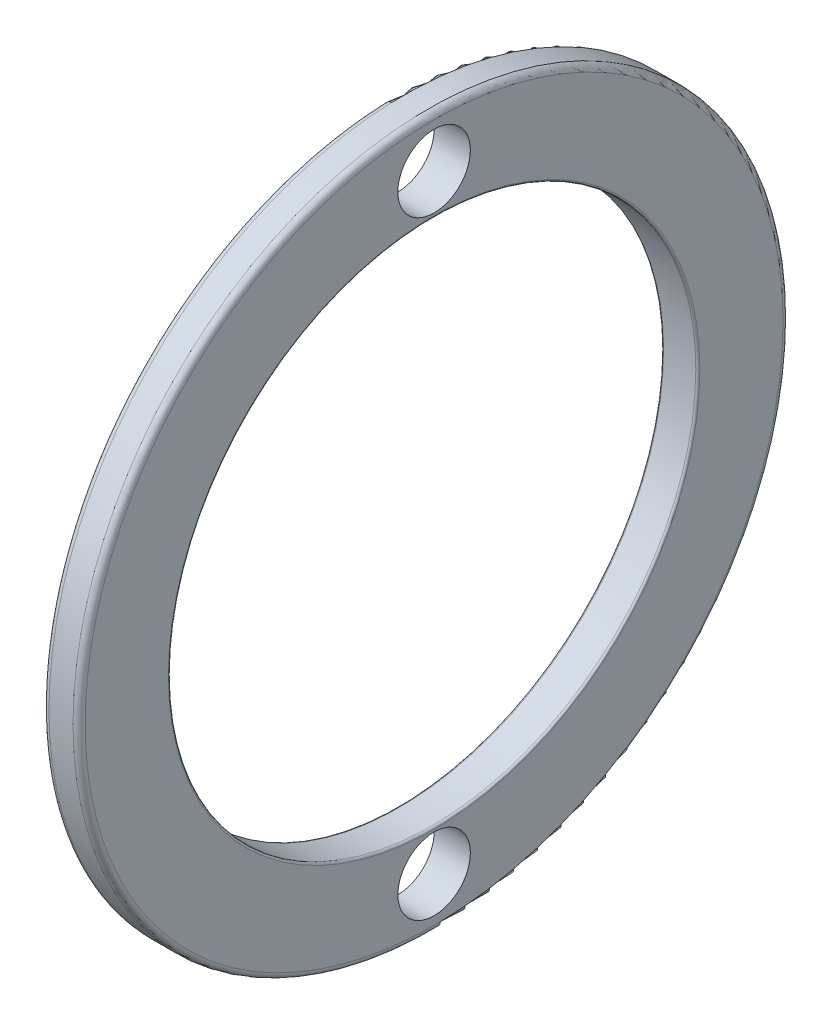
ISO-10303-21;
HEADER;
FILE_DESCRIPTION(('STEP AP214'),'2;1');
FILE_NAME('part.step','',(''),(''),'','','');
FILE_SCHEMA(('AUTOMOTIVE_DESIGN { 1 0 10303 214 1 1 1 1 }'));
ENDSEC;
DATA;
#1=APPLICATION_CONTEXT('core data for automotive mechanical design processes');
#2=APPLICATION_PROTOCOL_DEFINITION('international standard','automotive_design',2000,#1);
#3=PRODUCT_CONTEXT('',#1,'mechanical');
#4=PRODUCT('Part','Part','',(#3));
#5=PRODUCT_RELATED_PRODUCT_CATEGORY('part','',(#4));
#6=PRODUCT_DEFINITION_FORMATION('','',#4);
#7=PRODUCT_DEFINITION_CONTEXT('part definition',#1,'design');
#8=PRODUCT_DEFINITION('design','',#6,#7);
#9=PRODUCT_DEFINITION_SHAPE('','',#8);
#10=(LENGTH_UNIT() NAMED_UNIT(*) SI_UNIT(.MILLI.,.METRE.));
#11=(NAMED_UNIT(*) PLANE_ANGLE_UNIT() SI_UNIT($,.RADIAN.));
#12=(NAMED_UNIT(*) SI_UNIT($,.STERADIAN.) SOLID_ANGLE_UNIT());
#13=UNCERTAINTY_MEASURE_WITH_UNIT(LENGTH_MEASURE(1.E-05),#10,'distance_accuracy_value','');
#14=(GEOMETRIC_REPRESENTATION_CONTEXT(3) GLOBAL_UNCERTAINTY_ASSIGNED_CONTEXT((#13)) GLOBAL_UNIT_ASSIGNED_CONTEXT((#10,
#11,#12)) REPRESENTATION_CONTEXT('',''));
#15=CARTESIAN_POINT('',(0.,0.,0.));
#16=DIRECTION('',(0.,0.,1.));
#17=DIRECTION('',(1.,0.,0.));
#18=AXIS2_PLACEMENT_3D('',#15,#16,#17);
#19=CARTESIAN_POINT('',(5.214,34.4,0.));
#20=DIRECTION('',(-1.,0.,0.));
#21=DIRECTION('',(0.,0.,1.));
#22=AXIS2_PLACEMENT_3D('',#19,#20,#21);
#23=PLANE('',#22);
#24=CARTESIAN_POINT('',(5.214,30.,0.));
#25=DIRECTION('',(-1.,0.,0.));
#26=DIRECTION('',(0.,0.,1.));
#27=AXIS2_PLACEMENT_3D('',#24,#25,#26);
#28=CIRCLE('',#27,3.572);
#29=CARTESIAN_POINT('',(5.214,30.,3.572));
#30=VERTEX_POINT('',#29);
#31=EDGE_CURVE('E47',#30,#30,#28,.F.);
#32=ORIENTED_EDGE('',*,*,#31,.T.);
#33=EDGE_LOOP('',(#32));
#34=FACE_BOUND('',#33,.T.);
#35=CARTESIAN_POINT('',(5.214,0.,0.));
#36=DIRECTION('',(1.,0.,0.));
#37=DIRECTION('',(0.,0.,-1.));
#38=AXIS2_PLACEMENT_3D('',#35,#36,#37);
#39=CIRCLE('',#38,26.2);
#40=CARTESIAN_POINT('',(5.214,0.,-26.2));
#41=VERTEX_POINT('',#40);
#42=EDGE_CURVE('E37',#41,#41,#39,.T.);
#43=ORIENTED_EDGE('',*,*,#42,.T.);
#44=EDGE_LOOP('',(#43));
#45=FACE_BOUND('',#44,.T.);
#46=CARTESIAN_POINT('',(5.214,0.,0.));
#47=DIRECTION('',(1.,0.,0.));
#48=DIRECTION('',(0.,0.,-1.));
#49=AXIS2_PLACEMENT_3D('',#46,#47,#48);
#50=CIRCLE('',#49,34.4);
#51=CARTESIAN_POINT('',(5.214,0.,-34.4));
#52=VERTEX_POINT('',#51);
#53=EDGE_CURVE('E10',#52,#52,#50,.T.);
#54=ORIENTED_EDGE('',*,*,#53,.F.);
#55=EDGE_LOOP('',(#54));
#56=FACE_BOUND('',#55,.T.);
#57=CARTESIAN_POINT('',(5.214,-30.,0.));
#58=DIRECTION('',(-1.,0.,0.));
#59=DIRECTION('',(0.,0.,1.));
#60=AXIS2_PLACEMENT_3D('',#57,#58,#59);
#61=CIRCLE('',#60,3.572);
#62=CARTESIAN_POINT('',(5.214,-30.,3.572));
#63=VERTEX_POINT('',#62);
#64=EDGE_CURVE('E48',#63,#63,#61,.F.);
#65=ORIENTED_EDGE('',*,*,#64,.T.);
#66=EDGE_LOOP('',(#65));
#67=FACE_BOUND('',#66,.T.);
#68=ADVANCED_FACE('F29',(#34,#45,#56,#67),#23,.T.);
#69=CARTESIAN_POINT('',(8.786,26.2,0.));
#70=DIRECTION('',(1.,0.,0.));
#71=DIRECTION('',(0.,0.,-1.));
#72=AXIS2_PLACEMENT_3D('',#69,#70,#71);
#73=PLANE('',#72);
#74=CARTESIAN_POINT('',(8.786,30.,0.));
#75=DIRECTION('',(1.,0.,0.));
#76=DIRECTION('',(0.,0.,-1.));
#77=AXIS2_PLACEMENT_3D('',#74,#75,#76);
#78=CIRCLE('',#77,3.572);
#79=CARTESIAN_POINT('',(8.786,30.,-3.572));
#80=VERTEX_POINT('',#79);
#81=EDGE_CURVE('E45',#80,#80,#78,.F.);
#82=ORIENTED_EDGE('',*,*,#81,.T.);
#83=EDGE_LOOP('',(#82));
#84=FACE_BOUND('',#83,.T.);
#85=CARTESIAN_POINT('',(8.786,0.,0.));
#86=DIRECTION('',(1.,0.,0.));
#87=DIRECTION('',(0.,0.,-1.));
#88=AXIS2_PLACEMENT_3D('',#85,#86,#87);
#89=CIRCLE('',#88,34.4);
#90=CARTESIAN_POINT('',(8.786,0.,-34.4));
#91=VERTEX_POINT('',#90);
#92=EDGE_CURVE('E65',#91,#91,#89,.T.);
#93=ORIENTED_EDGE('',*,*,#92,.T.);
#94=EDGE_LOOP('',(#93));
#95=FACE_BOUND('',#94,.T.);
#96=CARTESIAN_POINT('',(8.786,0.,0.));
#97=DIRECTION('',(1.,0.,0.));
#98=DIRECTION('',(0.,0.,-1.));
#99=AXIS2_PLACEMENT_3D('',#96,#97,#98);
#100=CIRCLE('',#99,26.2);
#101=CARTESIAN_POINT('',(8.786,0.,-26.2));
#102=VERTEX_POINT('',#101);
#103=EDGE_CURVE('E68',#102,#102,#100,.T.);
#104=ORIENTED_EDGE('',*,*,#103,.F.);
#105=EDGE_LOOP('',(#104));
#106=FACE_BOUND('',#105,.T.);
#107=CARTESIAN_POINT('',(8.786,-30.,0.));
#108=DIRECTION('',(1.,0.,0.));
#109=DIRECTION('',(0.,0.,-1.));
#110=AXIS2_PLACEMENT_3D('',#107,#108,#109);
#111=CIRCLE('',#110,3.572);
#112=CARTESIAN_POINT('',(8.786,-30.,-3.572));
#113=VERTEX_POINT('',#112);
#114=EDGE_CURVE('E33',#113,#113,#111,.F.);
#115=ORIENTED_EDGE('',*,*,#114,.T.);
#116=EDGE_LOOP('',(#115));
#117=FACE_BOUND('',#116,.T.);
#118=ADVANCED_FACE('F93',(#84,#95,#106,#117),#73,.T.);
#119=CARTESIAN_POINT('',(5.81399999999993,0.,0.));
#120=DIRECTION('',(1.,0.,0.));
#121=DIRECTION('',(0.,0.,-1.));
#122=AXIS2_PLACEMENT_3D('',#119,#120,#121);
#123=TOROIDAL_SURFACE('',#122,34.4000000000001,0.599999999999928);
#124=ORIENTED_EDGE('',*,*,#53,.T.);
#125=EDGE_LOOP('',(#124));
#126=FACE_BOUND('',#125,.T.);
#127=CARTESIAN_POINT('',(5.814,0.,0.));
#128=DIRECTION('',(1.,0.,0.));
#129=DIRECTION('',(0.,0.,-1.));
#130=AXIS2_PLACEMENT_3D('',#127,#128,#129);
#131=CIRCLE('',#130,35.);
#132=CARTESIAN_POINT('',(5.814,0.,-35.));
#133=VERTEX_POINT('',#132);
#134=EDGE_CURVE('E52',#133,#133,#131,.T.);
#135=ORIENTED_EDGE('',*,*,#134,.F.);
#136=EDGE_LOOP('',(#135));
#137=FACE_BOUND('',#136,.T.);
#138=ADVANCED_FACE('F31',(#126,#137),#123,.T.);
#139=CARTESIAN_POINT('',(5.41400000000055,0.,0.));
#140=DIRECTION('',(1.,0.,0.));
#141=DIRECTION('',(0.,0.,-1.));
#142=AXIS2_PLACEMENT_3D('',#139,#140,#141);
#143=TOROIDAL_SURFACE('',#142,26.2000000000005,0.200000000000551);
#144=CARTESIAN_POINT('',(5.414,0.,0.));
#145=DIRECTION('',(1.,0.,0.));
#146=DIRECTION('',(0.,0.,-1.));
#147=AXIS2_PLACEMENT_3D('',#144,#145,#146);
#148=CIRCLE('',#147,26.);
#149=CARTESIAN_POINT('',(5.414,0.,-26.));
#150=VERTEX_POINT('',#149);
#151=EDGE_CURVE('E42',#150,#150,#148,.T.);
#152=ORIENTED_EDGE('',*,*,#151,.T.);
#153=EDGE_LOOP('',(#152));
#154=FACE_BOUND('',#153,.T.);
#155=ORIENTED_EDGE('',*,*,#42,.F.);
#156=EDGE_LOOP('',(#155));
#157=FACE_BOUND('',#156,.T.);
#158=ADVANCED_FACE('F76',(#154,#157),#143,.T.);
#159=CARTESIAN_POINT('',(50.,0.,0.));
#160=DIRECTION('',(1.,0.,0.));
#161=DIRECTION('',(0.,0.,-1.));
#162=AXIS2_PLACEMENT_3D('',#159,#160,#161);
#163=CYLINDRICAL_SURFACE('',#162,26.);
#164=CARTESIAN_POINT('',(8.586,0.,0.));
#165=DIRECTION('',(1.,0.,0.));
#166=DIRECTION('',(0.,0.,-1.));
#167=AXIS2_PLACEMENT_3D('',#164,#165,#166);
#168=CIRCLE('',#167,26.);
#169=CARTESIAN_POINT('',(8.586,0.,-26.));
#170=VERTEX_POINT('',#169);
#171=EDGE_CURVE('E71',#170,#170,#168,.T.);
#172=ORIENTED_EDGE('',*,*,#171,.T.);
#173=EDGE_LOOP('',(#172));
#174=FACE_BOUND('',#173,.T.);
#175=ORIENTED_EDGE('',*,*,#151,.F.);
#176=EDGE_LOOP('',(#175));
#177=FACE_BOUND('',#176,.T.);
#178=ADVANCED_FACE('F79',(#174,#177),#163,.F.);
#179=CARTESIAN_POINT('',(8.58599999999945,0.,0.));
#180=DIRECTION('',(1.,0.,0.));
#181=DIRECTION('',(0.,0.,-1.));
#182=AXIS2_PLACEMENT_3D('',#179,#180,#181);
#183=TOROIDAL_SURFACE('',#182,26.2000000000005,0.200000000000548);
#184=ORIENTED_EDGE('',*,*,#103,.T.);
#185=EDGE_LOOP('',(#184));
#186=FACE_BOUND('',#185,.T.);
#187=ORIENTED_EDGE('',*,*,#171,.F.);
#188=EDGE_LOOP('',(#187));
#189=FACE_BOUND('',#188,.T.);
#190=ADVANCED_FACE('F81',(#186,#189),#183,.T.);
#191=CARTESIAN_POINT('',(8.18600000000007,0.,0.));
#192=DIRECTION('',(1.,0.,0.));
#193=DIRECTION('',(0.,0.,-1.));
#194=AXIS2_PLACEMENT_3D('',#191,#192,#193);
#195=TOROIDAL_SURFACE('',#194,34.4000000000001,0.599999999999932);
#196=CARTESIAN_POINT('',(8.186,0.,0.));
#197=DIRECTION('',(1.,0.,0.));
#198=DIRECTION('',(0.,0.,-1.));
#199=AXIS2_PLACEMENT_3D('',#196,#197,#198);
#200=CIRCLE('',#199,35.);
#201=CARTESIAN_POINT('',(8.186,0.,-35.));
#202=VERTEX_POINT('',#201);
#203=EDGE_CURVE('E62',#202,#202,#200,.T.);
#204=ORIENTED_EDGE('',*,*,#203,.T.);
#205=EDGE_LOOP('',(#204));
#206=FACE_BOUND('',#205,.T.);
#207=ORIENTED_EDGE('',*,*,#92,.F.);
#208=EDGE_LOOP('',(#207));
#209=FACE_BOUND('',#208,.T.);
#210=ADVANCED_FACE('F88',(#206,#209),#195,.T.);
#211=CARTESIAN_POINT('',(50.,0.,0.));
#212=DIRECTION('',(1.,0.,0.));
#213=DIRECTION('',(0.,0.,-1.));
#214=AXIS2_PLACEMENT_3D('',#211,#212,#213);
#215=CYLINDRICAL_SURFACE('',#214,35.);
#216=ORIENTED_EDGE('',*,*,#134,.T.);
#217=EDGE_LOOP('',(#216));
#218=FACE_BOUND('',#217,.T.);
#219=ORIENTED_EDGE('',*,*,#203,.F.);
#220=EDGE_LOOP('',(#219));
#221=FACE_BOUND('',#220,.T.);
#222=ADVANCED_FACE('F108',(#218,#221),#215,.T.);
#223=CARTESIAN_POINT('',(12.358,30.,0.));
#224=DIRECTION('',(-1.,0.,0.));
#225=DIRECTION('',(0.,0.,1.));
#226=AXIS2_PLACEMENT_3D('',#223,#224,#225);
#227=CYLINDRICAL_SURFACE('',#226,3.572);
#228=ORIENTED_EDGE('',*,*,#31,.F.);
#229=EDGE_LOOP('',(#228));
#230=FACE_BOUND('',#229,.T.);
#231=ORIENTED_EDGE('',*,*,#81,.F.);
#232=EDGE_LOOP('',(#231));
#233=FACE_BOUND('',#232,.T.);
#234=ADVANCED_FACE('F104',(#230,#233),#227,.F.);
#235=CARTESIAN_POINT('',(12.358,-30.,0.));
#236=DIRECTION('',(-1.,0.,0.));
#237=DIRECTION('',(0.,0.,1.));
#238=AXIS2_PLACEMENT_3D('',#235,#236,#237);
#239=CYLINDRICAL_SURFACE('',#238,3.572);
#240=ORIENTED_EDGE('',*,*,#64,.F.);
#241=EDGE_LOOP('',(#240));
#242=FACE_BOUND('',#241,.T.);
#243=ORIENTED_EDGE('',*,*,#114,.F.);
#244=EDGE_LOOP('',(#243));
#245=FACE_BOUND('',#244,.T.);
#246=ADVANCED_FACE('F107',(#242,#245),#239,.F.);
#247=CLOSED_SHELL('',(#68,#118,#138,#158,#178,#190,#210,#222,#234,#246));
#248=MANIFOLD_SOLID_BREP('B2',#247);
#249=ADVANCED_BREP_SHAPE_REPRESENTATION('',(#18,#248),#14);
#250=SHAPE_DEFINITION_REPRESENTATION(#9,#249);
ENDSEC;
END-ISO-10303-21;
